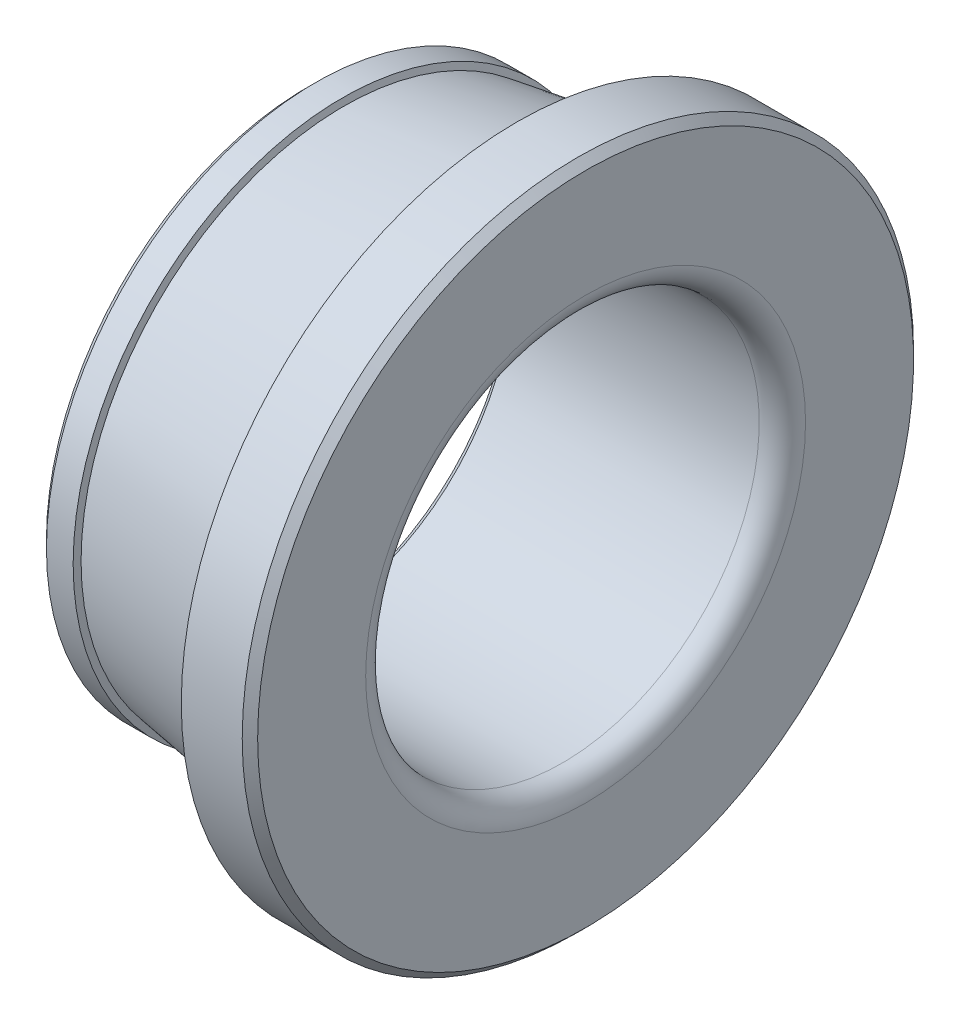
ISO-10303-21;
HEADER;
FILE_DESCRIPTION(('STEP AP214'),'2;1');
FILE_NAME('part.step','',(''),(''),'','','');
FILE_SCHEMA(('AUTOMOTIVE_DESIGN { 1 0 10303 214 1 1 1 1 }'));
ENDSEC;
DATA;
#1=APPLICATION_CONTEXT('core data for automotive mechanical design processes');
#2=APPLICATION_PROTOCOL_DEFINITION('international standard','automotive_design',2000,#1);
#3=PRODUCT_CONTEXT('',#1,'mechanical');
#4=PRODUCT('Part','Part','',(#3));
#5=PRODUCT_RELATED_PRODUCT_CATEGORY('part','',(#4));
#6=PRODUCT_DEFINITION_FORMATION('','',#4);
#7=PRODUCT_DEFINITION_CONTEXT('part definition',#1,'design');
#8=PRODUCT_DEFINITION('design','',#6,#7);
#9=PRODUCT_DEFINITION_SHAPE('','',#8);
#10=(LENGTH_UNIT() NAMED_UNIT(*) SI_UNIT(.MILLI.,.METRE.));
#11=(NAMED_UNIT(*) PLANE_ANGLE_UNIT() SI_UNIT($,.RADIAN.));
#12=(NAMED_UNIT(*) SI_UNIT($,.STERADIAN.) SOLID_ANGLE_UNIT());
#13=UNCERTAINTY_MEASURE_WITH_UNIT(LENGTH_MEASURE(1.E-05),#10,'distance_accuracy_value','');
#14=(GEOMETRIC_REPRESENTATION_CONTEXT(3) GLOBAL_UNCERTAINTY_ASSIGNED_CONTEXT((#13)) GLOBAL_UNIT_ASSIGNED_CONTEXT((#10,
#11,#12)) REPRESENTATION_CONTEXT('',''));
#15=CARTESIAN_POINT('',(0.,0.,0.));
#16=DIRECTION('',(0.,0.,1.));
#17=DIRECTION('',(1.,0.,0.));
#18=AXIS2_PLACEMENT_3D('',#15,#16,#17);
#19=CARTESIAN_POINT('',(1.25,-11.5991723646067,-11.290666666667));
#20=DIRECTION('',(-1.,0.,0.));
#21=DIRECTION('',(0.,0.,1.));
#22=AXIS2_PLACEMENT_3D('',#19,#20,#21);
#23=PLANE('',#22);
#24=CARTESIAN_POINT('',(1.25,0.,0.));
#25=DIRECTION('',(-1.,0.,0.));
#26=DIRECTION('',(0.,0.,-1.));
#27=AXIS2_PLACEMENT_3D('',#24,#25,#26);
#28=CIRCLE('',#27,11.290666666667);
#29=CARTESIAN_POINT('',(1.25,0.,-11.290666666667));
#30=VERTEX_POINT('',#29);
#31=EDGE_CURVE('E56',#30,#30,#28,.F.);
#32=ORIENTED_EDGE('',*,*,#31,.F.);
#33=EDGE_LOOP('',(#32));
#34=FACE_BOUND('',#33,.T.);
#35=CARTESIAN_POINT('',(1.25,0.,0.));
#36=DIRECTION('',(1.,0.,0.));
#37=DIRECTION('',(0.,0.,1.));
#38=AXIS2_PLACEMENT_3D('',#35,#36,#37);
#39=CIRCLE('',#38,8.8333333333333);
#40=CARTESIAN_POINT('',(1.25,0.,8.8333333333333));
#41=VERTEX_POINT('',#40);
#42=EDGE_CURVE('E53',#41,#41,#39,.T.);
#43=ORIENTED_EDGE('',*,*,#42,.T.);
#44=EDGE_LOOP('',(#43));
#45=FACE_BOUND('',#44,.T.);
#46=ADVANCED_FACE('F15',(#34,#45),#23,.T.);
#47=CARTESIAN_POINT('',(13.25,-14.4298315117084,14.166666666667));
#48=DIRECTION('',(1.,0.,0.));
#49=DIRECTION('',(0.,0.,-1.));
#50=AXIS2_PLACEMENT_3D('',#47,#48,#49);
#51=PLANE('',#50);
#52=CARTESIAN_POINT('',(13.25,0.,0.));
#53=DIRECTION('',(1.,0.,0.));
#54=DIRECTION('',(0.,-1.16855845784114E-09,1.));
#55=AXIS2_PLACEMENT_3D('',#52,#53,#54);
#56=CIRCLE('',#55,14.166666666667);
#57=CARTESIAN_POINT('',(13.25,-1.65545781527499E-08,14.166666666667));
#58=VERTEX_POINT('',#57);
#59=EDGE_CURVE('E50',#58,#58,#56,.T.);
#60=ORIENTED_EDGE('',*,*,#59,.T.);
#61=EDGE_LOOP('',(#60));
#62=FACE_BOUND('',#61,.T.);
#63=CARTESIAN_POINT('',(13.25,0.,0.));
#64=DIRECTION('',(-1.,0.,0.));
#65=DIRECTION('',(0.,0.,-1.));
#66=AXIS2_PLACEMENT_3D('',#63,#64,#65);
#67=CIRCLE('',#66,9.50000008815576);
#68=CARTESIAN_POINT('',(13.25,0.,-9.50000008815576));
#69=VERTEX_POINT('',#68);
#70=EDGE_CURVE('E47',#69,#69,#67,.F.);
#71=ORIENTED_EDGE('',*,*,#70,.F.);
#72=EDGE_LOOP('',(#71));
#73=FACE_BOUND('',#72,.T.);
#74=ADVANCED_FACE('F64',(#62,#73),#51,.T.);
#75=CARTESIAN_POINT('',(1.25,0.,0.));
#76=DIRECTION('',(-1.,0.,0.));
#77=DIRECTION('',(0.,0.,-1.));
#78=AXIS2_PLACEMENT_3D('',#75,#76,#77);
#79=CONICAL_SURFACE('',#78,8.8333333333333,0.785398163397448);
#80=ORIENTED_EDGE('',*,*,#42,.F.);
#81=EDGE_LOOP('',(#80));
#82=FACE_BOUND('',#81,.T.);
#83=CARTESIAN_POINT('',(1.5833333333333,0.,0.));
#84=DIRECTION('',(1.,0.,0.));
#85=DIRECTION('',(0.,0.,1.));
#86=AXIS2_PLACEMENT_3D('',#83,#84,#85);
#87=CIRCLE('',#86,8.5);
#88=CARTESIAN_POINT('',(1.5833333333333,0.,8.5));
#89=VERTEX_POINT('',#88);
#90=EDGE_CURVE('E44',#89,#89,#87,.T.);
#91=ORIENTED_EDGE('',*,*,#90,.T.);
#92=EDGE_LOOP('',(#91));
#93=FACE_BOUND('',#92,.T.);
#94=ADVANCED_FACE('F68',(#82,#93),#79,.F.);
#95=CARTESIAN_POINT('',(13.25,0.,0.));
#96=DIRECTION('',(1.,0.,0.));
#97=DIRECTION('',(0.,0.,1.));
#98=AXIS2_PLACEMENT_3D('',#95,#96,#97);
#99=CYLINDRICAL_SURFACE('',#98,8.5);
#100=CARTESIAN_POINT('',(12.25,0.,0.));
#101=DIRECTION('',(1.,0.,0.));
#102=DIRECTION('',(0.,0.,1.));
#103=AXIS2_PLACEMENT_3D('',#100,#101,#102);
#104=CIRCLE('',#103,8.5);
#105=CARTESIAN_POINT('',(12.25,0.,8.5));
#106=VERTEX_POINT('',#105);
#107=EDGE_CURVE('E41',#106,#106,#104,.T.);
#108=ORIENTED_EDGE('',*,*,#107,.T.);
#109=EDGE_LOOP('',(#108));
#110=FACE_BOUND('',#109,.T.);
#111=ORIENTED_EDGE('',*,*,#90,.F.);
#112=EDGE_LOOP('',(#111));
#113=FACE_BOUND('',#112,.T.);
#114=ADVANCED_FACE('F71',(#110,#113),#99,.F.);
#115=CARTESIAN_POINT('',(12.2500000000007,0.,0.));
#116=DIRECTION('',(1.,0.,0.));
#117=DIRECTION('',(0.,0.,1.));
#118=AXIS2_PLACEMENT_3D('',#115,#116,#117);
#119=TOROIDAL_SURFACE('',#118,9.4999999999993,0.999999999999304);
#120=ORIENTED_EDGE('',*,*,#70,.T.);
#121=EDGE_LOOP('',(#120));
#122=FACE_BOUND('',#121,.T.);
#123=ORIENTED_EDGE('',*,*,#107,.F.);
#124=EDGE_LOOP('',(#123));
#125=FACE_BOUND('',#124,.T.);
#126=ADVANCED_FACE('F76',(#122,#125),#119,.T.);
#127=CARTESIAN_POINT('',(12.916666666667,0.,0.));
#128=DIRECTION('',(-1.,0.,0.));
#129=DIRECTION('',(0.,0.,-1.));
#130=AXIS2_PLACEMENT_3D('',#127,#128,#129);
#131=CONICAL_SURFACE('',#130,14.5,0.785398163397447);
#132=ORIENTED_EDGE('',*,*,#59,.F.);
#133=EDGE_LOOP('',(#132));
#134=FACE_BOUND('',#133,.T.);
#135=CARTESIAN_POINT('',(12.916666666667,0.,0.));
#136=DIRECTION('',(1.,0.,0.));
#137=DIRECTION('',(0.,0.,1.));
#138=AXIS2_PLACEMENT_3D('',#135,#136,#137);
#139=CIRCLE('',#138,14.5);
#140=CARTESIAN_POINT('',(12.916666666667,0.,14.5));
#141=VERTEX_POINT('',#140);
#142=EDGE_CURVE('E38',#141,#141,#139,.T.);
#143=ORIENTED_EDGE('',*,*,#142,.T.);
#144=EDGE_LOOP('',(#143));
#145=FACE_BOUND('',#144,.T.);
#146=ADVANCED_FACE('F83',(#134,#145),#131,.T.);
#147=CARTESIAN_POINT('',(13.25,0.,0.));
#148=DIRECTION('',(1.,0.,0.));
#149=DIRECTION('',(0.,0.,1.));
#150=AXIS2_PLACEMENT_3D('',#147,#148,#149);
#151=CYLINDRICAL_SURFACE('',#150,14.5);
#152=CARTESIAN_POINT('',(10.284777756032,0.,0.));
#153=DIRECTION('',(1.,0.,0.));
#154=DIRECTION('',(0.,0.,1.));
#155=AXIS2_PLACEMENT_3D('',#152,#153,#154);
#156=CIRCLE('',#155,14.5);
#157=CARTESIAN_POINT('',(10.284777756032,0.,14.5));
#158=VERTEX_POINT('',#157);
#159=EDGE_CURVE('E35',#158,#158,#156,.T.);
#160=ORIENTED_EDGE('',*,*,#159,.T.);
#161=EDGE_LOOP('',(#160));
#162=FACE_BOUND('',#161,.T.);
#163=ORIENTED_EDGE('',*,*,#142,.F.);
#164=EDGE_LOOP('',(#163));
#165=FACE_BOUND('',#164,.T.);
#166=ADVANCED_FACE('F90',(#162,#165),#151,.T.);
#167=CARTESIAN_POINT('',(10.284777756032,0.,0.));
#168=DIRECTION('',(-1.,0.,0.));
#169=DIRECTION('',(0.,0.,-1.));
#170=AXIS2_PLACEMENT_3D('',#167,#168,#169);
#171=CONICAL_SURFACE('',#170,14.5,1.34472382878425);
#172=ORIENTED_EDGE('',*,*,#159,.F.);
#173=EDGE_LOOP('',(#172));
#174=FACE_BOUND('',#173,.T.);
#175=CARTESIAN_POINT('',(10.723659397817,0.,0.));
#176=DIRECTION('',(1.,0.,0.));
#177=DIRECTION('',(0.,0.,1.));
#178=AXIS2_PLACEMENT_3D('',#175,#176,#177);
#179=CIRCLE('',#178,12.591854850435);
#180=CARTESIAN_POINT('',(10.723659397817,0.,12.591854850435));
#181=VERTEX_POINT('',#180);
#182=EDGE_CURVE('E30',#181,#181,#179,.T.);
#183=ORIENTED_EDGE('',*,*,#182,.T.);
#184=EDGE_LOOP('',(#183));
#185=FACE_BOUND('',#184,.T.);
#186=ADVANCED_FACE('F94',(#174,#185),#171,.F.);
#187=CARTESIAN_POINT('',(10.723659397817,0.,0.));
#188=DIRECTION('',(1.,0.,0.));
#189=DIRECTION('',(0.,0.,1.));
#190=AXIS2_PLACEMENT_3D('',#187,#188,#189);
#191=CONICAL_SURFACE('',#190,12.591854850435,0.156049888420765);
#192=CARTESIAN_POINT('',(2.8014541539536,0.,0.));
#193=DIRECTION('',(1.,0.,0.));
#194=DIRECTION('',(0.,0.,1.));
#195=AXIS2_PLACEMENT_3D('',#192,#193,#194);
#196=CIRCLE('',#195,11.345461936107);
#197=CARTESIAN_POINT('',(2.8014541539536,0.,11.345461936107));
#198=VERTEX_POINT('',#197);
#199=EDGE_CURVE('E26',#198,#198,#196,.T.);
#200=ORIENTED_EDGE('',*,*,#199,.T.);
#201=EDGE_LOOP('',(#200));
#202=FACE_BOUND('',#201,.T.);
#203=ORIENTED_EDGE('',*,*,#182,.F.);
#204=EDGE_LOOP('',(#203));
#205=FACE_BOUND('',#204,.T.);
#206=ADVANCED_FACE('F98',(#202,#205),#191,.T.);
#207=CARTESIAN_POINT('',(2.7373891939011,0.,0.));
#208=DIRECTION('',(-1.,0.,0.));
#209=DIRECTION('',(0.,0.,-1.));
#210=AXIS2_PLACEMENT_3D('',#207,#208,#209);
#211=CONICAL_SURFACE('',#210,11.624,1.34472382878376);
#212=ORIENTED_EDGE('',*,*,#199,.F.);
#213=EDGE_LOOP('',(#212));
#214=FACE_BOUND('',#213,.T.);
#215=CARTESIAN_POINT('',(2.7373891939011,0.,0.));
#216=DIRECTION('',(1.,0.,0.));
#217=DIRECTION('',(0.,0.,1.));
#218=AXIS2_PLACEMENT_3D('',#215,#216,#217);
#219=CIRCLE('',#218,11.624);
#220=CARTESIAN_POINT('',(2.7373891939011,0.,11.624));
#221=VERTEX_POINT('',#220);
#222=EDGE_CURVE('E22',#221,#221,#219,.T.);
#223=ORIENTED_EDGE('',*,*,#222,.T.);
#224=EDGE_LOOP('',(#223));
#225=FACE_BOUND('',#224,.T.);
#226=ADVANCED_FACE('F102',(#214,#225),#211,.T.);
#227=CARTESIAN_POINT('',(13.25,0.,0.));
#228=DIRECTION('',(1.,0.,0.));
#229=DIRECTION('',(0.,0.,1.));
#230=AXIS2_PLACEMENT_3D('',#227,#228,#229);
#231=CYLINDRICAL_SURFACE('',#230,11.624);
#232=CARTESIAN_POINT('',(1.5833333333333,0.,0.));
#233=DIRECTION('',(1.,0.,0.));
#234=DIRECTION('',(0.,0.,1.));
#235=AXIS2_PLACEMENT_3D('',#232,#233,#234);
#236=CIRCLE('',#235,11.624);
#237=CARTESIAN_POINT('',(1.5833333333333,0.,11.624));
#238=VERTEX_POINT('',#237);
#239=EDGE_CURVE('E10',#238,#238,#236,.T.);
#240=ORIENTED_EDGE('',*,*,#239,.T.);
#241=EDGE_LOOP('',(#240));
#242=FACE_BOUND('',#241,.T.);
#243=ORIENTED_EDGE('',*,*,#222,.F.);
#244=EDGE_LOOP('',(#243));
#245=FACE_BOUND('',#244,.T.);
#246=ADVANCED_FACE('F105',(#242,#245),#231,.T.);
#247=CARTESIAN_POINT('',(1.5833333333333,0.,0.));
#248=DIRECTION('',(1.,0.,0.));
#249=DIRECTION('',(0.,0.,1.));
#250=AXIS2_PLACEMENT_3D('',#247,#248,#249);
#251=CONICAL_SURFACE('',#250,11.624,0.785398163396999);
#252=ORIENTED_EDGE('',*,*,#31,.T.);
#253=EDGE_LOOP('',(#252));
#254=FACE_BOUND('',#253,.T.);
#255=ORIENTED_EDGE('',*,*,#239,.F.);
#256=EDGE_LOOP('',(#255));
#257=FACE_BOUND('',#256,.T.);
#258=ADVANCED_FACE('F17',(#254,#257),#251,.T.);
#259=CLOSED_SHELL('',(#46,#74,#94,#114,#126,#146,#166,#186,#206,#226,#246,#258));
#260=MANIFOLD_SOLID_BREP('B1',#259);
#261=ADVANCED_BREP_SHAPE_REPRESENTATION('',(#18,#260),#14);
#262=SHAPE_DEFINITION_REPRESENTATION(#9,#261);
ENDSEC;
END-ISO-10303-21;
